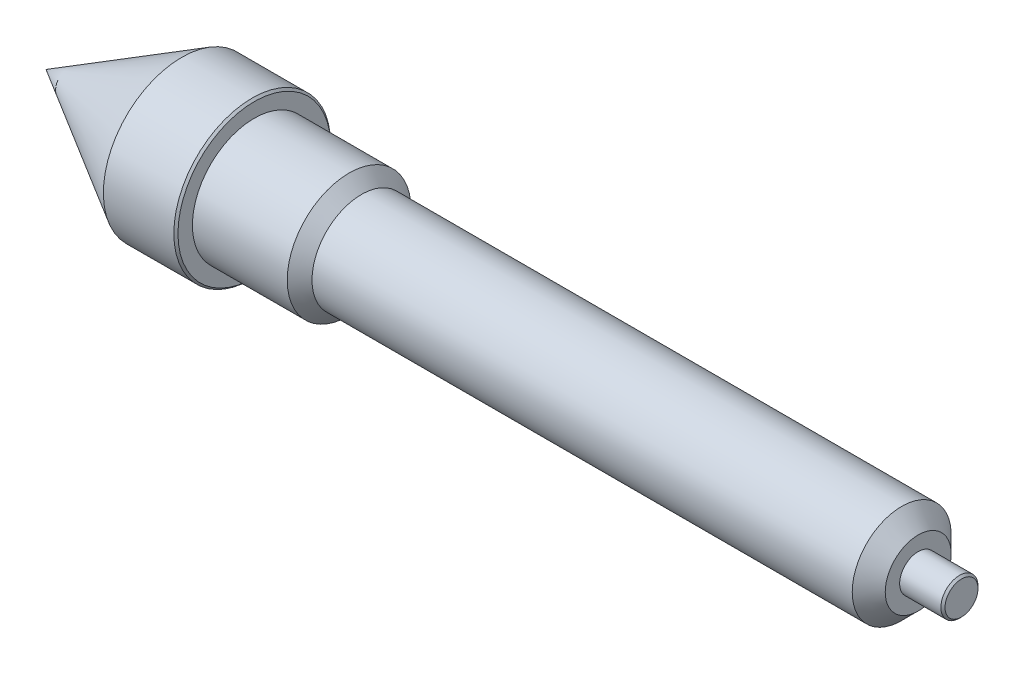
ISO-10303-21;
HEADER;
FILE_DESCRIPTION(('STEP AP214'),'2;1');
FILE_NAME('part.step','',(''),(''),'','','');
FILE_SCHEMA(('AUTOMOTIVE_DESIGN { 1 0 10303 214 1 1 1 1 }'));
ENDSEC;
DATA;
#1=APPLICATION_CONTEXT('core data for automotive mechanical design processes');
#2=APPLICATION_PROTOCOL_DEFINITION('international standard','automotive_design',2000,#1);
#3=PRODUCT_CONTEXT('',#1,'mechanical');
#4=PRODUCT('Part','Part','',(#3));
#5=PRODUCT_RELATED_PRODUCT_CATEGORY('part','',(#4));
#6=PRODUCT_DEFINITION_FORMATION('','',#4);
#7=PRODUCT_DEFINITION_CONTEXT('part definition',#1,'design');
#8=PRODUCT_DEFINITION('design','',#6,#7);
#9=PRODUCT_DEFINITION_SHAPE('','',#8);
#10=(LENGTH_UNIT() NAMED_UNIT(*) SI_UNIT(.MILLI.,.METRE.));
#11=(NAMED_UNIT(*) PLANE_ANGLE_UNIT() SI_UNIT($,.RADIAN.));
#12=(NAMED_UNIT(*) SI_UNIT($,.STERADIAN.) SOLID_ANGLE_UNIT());
#13=UNCERTAINTY_MEASURE_WITH_UNIT(LENGTH_MEASURE(1.E-05),#10,'distance_accuracy_value','');
#14=(GEOMETRIC_REPRESENTATION_CONTEXT(3) GLOBAL_UNCERTAINTY_ASSIGNED_CONTEXT((#13)) GLOBAL_UNIT_ASSIGNED_CONTEXT((#10,
#11,#12)) REPRESENTATION_CONTEXT('',''));
#15=CARTESIAN_POINT('',(0.,0.,0.));
#16=DIRECTION('',(0.,0.,1.));
#17=DIRECTION('',(1.,0.,0.));
#18=AXIS2_PLACEMENT_3D('',#15,#16,#17);
#19=CARTESIAN_POINT('',(10.5,0.,0.));
#20=DIRECTION('',(-1.,0.,0.));
#21=DIRECTION('',(0.,0.,1.));
#22=AXIS2_PLACEMENT_3D('',#19,#20,#21);
#23=CYLINDRICAL_SURFACE('',#22,4.5);
#24=CARTESIAN_POINT('',(10.,0.,0.));
#25=DIRECTION('',(1.,0.,0.));
#26=DIRECTION('',(0.,0.,-1.));
#27=AXIS2_PLACEMENT_3D('',#24,#25,#26);
#28=CIRCLE('',#27,4.5);
#29=CARTESIAN_POINT('',(10.,0.,4.5));
#30=VERTEX_POINT('',#29);
#31=EDGE_CURVE('E75',#30,#30,#28,.F.);
#32=CARTESIAN_POINT('',(0.,0.,0.));
#33=DIRECTION('',(1.,0.,0.));
#34=DIRECTION('',(0.,0.,-1.));
#35=AXIS2_PLACEMENT_3D('',#32,#33,#34);
#36=CIRCLE('',#35,4.5);
#37=CARTESIAN_POINT('',(0.,0.,4.5));
#38=VERTEX_POINT('',#37);
#39=EDGE_CURVE('E69',#38,#38,#36,.T.);
#40=CARTESIAN_POINT('',(10.,0.,4.5));
#41=CARTESIAN_POINT('',(9.89583333333333,0.,4.5));
#42=CARTESIAN_POINT('',(9.79166666666666,0.,4.5));
#43=CARTESIAN_POINT('',(9.58333333333333,0.,4.5));
#44=CARTESIAN_POINT('',(9.47916666666667,0.,4.5));
#45=CARTESIAN_POINT('',(9.27083333333333,0.,4.5));
#46=CARTESIAN_POINT('',(9.16666666666666,0.,4.5));
#47=CARTESIAN_POINT('',(8.95833333333333,0.,4.5));
#48=CARTESIAN_POINT('',(8.85416666666666,0.,4.5));
#49=CARTESIAN_POINT('',(8.64583333333333,0.,4.5));
#50=CARTESIAN_POINT('',(8.54166666666666,0.,4.5));
#51=CARTESIAN_POINT('',(8.33333333333333,0.,4.5));
#52=CARTESIAN_POINT('',(8.22916666666667,0.,4.5));
#53=CARTESIAN_POINT('',(8.02083333333333,0.,4.5));
#54=CARTESIAN_POINT('',(7.91666666666667,0.,4.5));
#55=CARTESIAN_POINT('',(7.70833333333333,0.,4.5));
#56=CARTESIAN_POINT('',(7.60416666666666,0.,4.5));
#57=CARTESIAN_POINT('',(7.39583333333333,0.,4.5));
#58=CARTESIAN_POINT('',(7.29166666666666,0.,4.5));
#59=CARTESIAN_POINT('',(7.08333333333333,0.,4.5));
#60=CARTESIAN_POINT('',(6.97916666666667,0.,4.5));
#61=CARTESIAN_POINT('',(6.77083333333333,0.,4.5));
#62=CARTESIAN_POINT('',(6.66666666666667,0.,4.5));
#63=CARTESIAN_POINT('',(6.45833333333333,0.,4.5));
#64=CARTESIAN_POINT('',(6.35416666666667,0.,4.5));
#65=CARTESIAN_POINT('',(6.14583333333333,0.,4.5));
#66=CARTESIAN_POINT('',(6.04166666666667,0.,4.5));
#67=CARTESIAN_POINT('',(5.83333333333333,0.,4.5));
#68=CARTESIAN_POINT('',(5.72916666666667,0.,4.5));
#69=CARTESIAN_POINT('',(5.52083333333333,0.,4.5));
#70=CARTESIAN_POINT('',(5.41666666666667,0.,4.5));
#71=CARTESIAN_POINT('',(5.20833333333333,0.,4.5));
#72=CARTESIAN_POINT('',(5.10416666666667,0.,4.5));
#73=CARTESIAN_POINT('',(4.89583333333333,0.,4.5));
#74=CARTESIAN_POINT('',(4.79166666666667,0.,4.5));
#75=CARTESIAN_POINT('',(4.58333333333333,0.,4.5));
#76=CARTESIAN_POINT('',(4.47916666666667,0.,4.5));
#77=CARTESIAN_POINT('',(4.27083333333333,0.,4.5));
#78=CARTESIAN_POINT('',(4.16666666666667,0.,4.5));
#79=CARTESIAN_POINT('',(3.95833333333333,0.,4.5));
#80=CARTESIAN_POINT('',(3.85416666666667,0.,4.5));
#81=CARTESIAN_POINT('',(3.64583333333333,0.,4.5));
#82=CARTESIAN_POINT('',(3.54166666666667,0.,4.5));
#83=CARTESIAN_POINT('',(3.33333333333333,0.,4.5));
#84=CARTESIAN_POINT('',(3.22916666666667,0.,4.5));
#85=CARTESIAN_POINT('',(3.02083333333333,0.,4.5));
#86=CARTESIAN_POINT('',(2.91666666666667,0.,4.5));
#87=CARTESIAN_POINT('',(2.70833333333333,0.,4.5));
#88=CARTESIAN_POINT('',(2.60416666666667,0.,4.5));
#89=CARTESIAN_POINT('',(2.39583333333333,0.,4.5));
#90=CARTESIAN_POINT('',(2.29166666666667,0.,4.5));
#91=CARTESIAN_POINT('',(2.08333333333333,0.,4.5));
#92=CARTESIAN_POINT('',(1.97916666666667,0.,4.5));
#93=CARTESIAN_POINT('',(1.77083333333333,0.,4.5));
#94=CARTESIAN_POINT('',(1.66666666666667,0.,4.5));
#95=CARTESIAN_POINT('',(1.45833333333333,0.,4.5));
#96=CARTESIAN_POINT('',(1.35416666666667,0.,4.5));
#97=CARTESIAN_POINT('',(1.14583333333333,0.,4.5));
#98=CARTESIAN_POINT('',(1.04166666666667,0.,4.5));
#99=CARTESIAN_POINT('',(0.833333333333333,0.,4.5));
#100=CARTESIAN_POINT('',(0.729166666666667,0.,4.5));
#101=CARTESIAN_POINT('',(0.520833333333334,0.,4.5));
#102=CARTESIAN_POINT('',(0.416666666666667,0.,4.5));
#103=CARTESIAN_POINT('',(0.208333333333334,0.,4.5));
#104=CARTESIAN_POINT('',(0.104166666666667,0.,4.5));
#105=CARTESIAN_POINT('',(0.,0.,4.5));
#106=B_SPLINE_CURVE_WITH_KNOTS('',3,(#40,#41,#42,#43,#44,#45,#46,#47,#48,#49,#50,#51,#52,#53,
#54,#55,#56,#57,#58,#59,#60,#61,#62,#63,#64,#65,#66,#67,#68,#69,#70,#71,#72,#73,#74,#75,#76,#77,
#78,#79,#80,#81,#82,#83,#84,#85,#86,#87,#88,#89,#90,#91,#92,#93,#94,#95,#96,#97,#98,#99,#100,
#101,#102,#103,#104,#105),.UNSPECIFIED.,.F.,.F.,(4,2,2,2,2,2,2,2,2,2,2,2,2,2,2,2,2,2,2,2,2,2,2,
2,2,2,2,2,2,2,2,2,4),(0.,0.312499999999999,0.624999999999999,0.937499999999999,1.25,1.5625,
1.875,2.1875,2.5,2.8125,3.125,3.4375,3.75,4.0625,4.375,4.6875,5.,5.3125,5.625,5.9375,6.25,
6.5625,6.875,7.1875,7.5,7.8125,8.125,8.4375,8.75,9.0625,9.375,9.6875,10.),.UNSPECIFIED.);
#107=EDGE_CURVE('BSEAM41',#30,#38,#106,.T.);
#108=ORIENTED_EDGE('',*,*,#31,.T.);
#109=ORIENTED_EDGE('',*,*,#39,.T.);
#110=ORIENTED_EDGE('',*,*,#107,.T.);
#111=ORIENTED_EDGE('',*,*,#107,.F.);
#112=EDGE_LOOP('',(#108,#110,#109,#111));
#113=FACE_BOUND('',#112,.T.);
#114=ADVANCED_FACE('F41',(#113),#23,.T.);
#115=CARTESIAN_POINT('',(10.5,0.,0.));
#116=DIRECTION('',(1.,0.,0.));
#117=DIRECTION('',(0.,0.,-1.));
#118=AXIS2_PLACEMENT_3D('',#115,#116,#117);
#119=PLANE('',#118);
#120=CARTESIAN_POINT('',(10.5,0.,0.));
#121=DIRECTION('',(1.,0.,0.));
#122=DIRECTION('',(0.,0.,-1.));
#123=AXIS2_PLACEMENT_3D('',#120,#121,#122);
#124=CIRCLE('',#123,4.);
#125=CARTESIAN_POINT('',(10.5,0.,-4.));
#126=VERTEX_POINT('',#125);
#127=EDGE_CURVE('E72',#126,#126,#124,.T.);
#128=ORIENTED_EDGE('',*,*,#127,.T.);
#129=EDGE_LOOP('',(#128));
#130=FACE_BOUND('',#129,.T.);
#131=ADVANCED_FACE('F97',(#130),#119,.T.);
#132=CARTESIAN_POINT('',(10.5,0.,0.));
#133=DIRECTION('',(-1.,0.,0.));
#134=DIRECTION('',(0.,0.,1.));
#135=AXIS2_PLACEMENT_3D('',#132,#133,#134);
#136=CONICAL_SURFACE('',#135,4.,0.785398163397451);
#137=ORIENTED_EDGE('',*,*,#31,.F.);
#138=EDGE_LOOP('',(#137));
#139=FACE_BOUND('',#138,.T.);
#140=ORIENTED_EDGE('',*,*,#127,.F.);
#141=EDGE_LOOP('',(#140));
#142=FACE_BOUND('',#141,.T.);
#143=ADVANCED_FACE('F103',(#139,#142),#136,.T.);
#144=CARTESIAN_POINT('',(-135.,0.,0.));
#145=DIRECTION('',(1.,0.,0.));
#146=DIRECTION('',(0.,0.,-1.));
#147=AXIS2_PLACEMENT_3D('',#144,#145,#146);
#148=CYLINDRICAL_SURFACE('',#147,12.);
#149=CARTESIAN_POINT('',(-4.,0.,0.));
#150=DIRECTION('',(-1.,0.,0.));
#151=DIRECTION('',(0.,0.,1.));
#152=AXIS2_PLACEMENT_3D('',#149,#150,#151);
#153=CIRCLE('',#152,12.);
#154=CARTESIAN_POINT('',(-4.,0.,12.));
#155=VERTEX_POINT('',#154);
#156=EDGE_CURVE('E78',#155,#155,#153,.T.);
#157=ORIENTED_EDGE('',*,*,#156,.T.);
#158=EDGE_LOOP('',(#157));
#159=FACE_BOUND('',#158,.T.);
#160=CARTESIAN_POINT('',(-135.,0.,0.));
#161=DIRECTION('',(-1.,0.,0.));
#162=DIRECTION('',(0.,0.,1.));
#163=AXIS2_PLACEMENT_3D('',#160,#161,#162);
#164=CIRCLE('',#163,12.);
#165=CARTESIAN_POINT('',(-135.,0.,12.));
#166=VERTEX_POINT('',#165);
#167=EDGE_CURVE('E64',#166,#166,#164,.T.);
#168=ORIENTED_EDGE('',*,*,#167,.F.);
#169=EDGE_LOOP('',(#168));
#170=FACE_BOUND('',#169,.T.);
#171=ADVANCED_FACE('F115',(#159,#170),#148,.T.);
#172=CARTESIAN_POINT('',(0.,0.,0.));
#173=DIRECTION('',(-1.,0.,0.));
#174=DIRECTION('',(0.,0.,1.));
#175=AXIS2_PLACEMENT_3D('',#172,#173,#174);
#176=PLANE('',#175);
#177=CARTESIAN_POINT('',(0.,0.,0.));
#178=DIRECTION('',(-1.,0.,0.));
#179=DIRECTION('',(0.,0.,1.));
#180=AXIS2_PLACEMENT_3D('',#177,#178,#179);
#181=CIRCLE('',#180,7.99999999999998);
#182=CARTESIAN_POINT('',(0.,0.,7.99999999999998));
#183=VERTEX_POINT('',#182);
#184=EDGE_CURVE('E81',#183,#183,#181,.F.);
#185=ORIENTED_EDGE('',*,*,#184,.T.);
#186=EDGE_LOOP('',(#185));
#187=FACE_BOUND('',#186,.T.);
#188=ORIENTED_EDGE('',*,*,#39,.F.);
#189=EDGE_LOOP('',(#188));
#190=FACE_BOUND('',#189,.T.);
#191=ADVANCED_FACE('F123',(#187,#190),#176,.F.);
#192=CARTESIAN_POINT('',(-4.,0.,0.));
#193=DIRECTION('',(-1.,0.,0.));
#194=DIRECTION('',(0.,0.,1.));
#195=AXIS2_PLACEMENT_3D('',#192,#193,#194);
#196=CONICAL_SURFACE('',#195,12.,0.78539816339745);
#197=ORIENTED_EDGE('',*,*,#184,.F.);
#198=EDGE_LOOP('',(#197));
#199=FACE_BOUND('',#198,.T.);
#200=ORIENTED_EDGE('',*,*,#156,.F.);
#201=EDGE_LOOP('',(#200));
#202=FACE_BOUND('',#201,.T.);
#203=ADVANCED_FACE('F117',(#199,#202),#196,.T.);
#204=CARTESIAN_POINT('',(-161.,0.,0.));
#205=DIRECTION('',(1.,0.,0.));
#206=DIRECTION('',(0.,0.,-1.));
#207=AXIS2_PLACEMENT_3D('',#204,#205,#206);
#208=CYLINDRICAL_SURFACE('',#207,15.);
#209=CARTESIAN_POINT('',(-138.,0.,0.));
#210=DIRECTION('',(-1.,0.,0.));
#211=DIRECTION('',(0.,0.,1.));
#212=AXIS2_PLACEMENT_3D('',#209,#210,#211);
#213=CIRCLE('',#212,15.);
#214=CARTESIAN_POINT('',(-138.,0.,-15.));
#215=VERTEX_POINT('',#214);
#216=EDGE_CURVE('E84',#215,#215,#213,.T.);
#217=CARTESIAN_POINT('',(-161.,0.,0.));
#218=DIRECTION('',(-1.,0.,0.));
#219=DIRECTION('',(0.,0.,1.));
#220=AXIS2_PLACEMENT_3D('',#217,#218,#219);
#221=CIRCLE('',#220,15.);
#222=CARTESIAN_POINT('',(-161.,0.,-15.));
#223=VERTEX_POINT('',#222);
#224=EDGE_CURVE('E61',#223,#223,#221,.T.);
#225=CARTESIAN_POINT('',(-138.,0.,-15.));
#226=CARTESIAN_POINT('',(-138.239583333333,0.,-15.));
#227=CARTESIAN_POINT('',(-138.479166666667,0.,-15.));
#228=CARTESIAN_POINT('',(-138.958333333333,0.,-15.));
#229=CARTESIAN_POINT('',(-139.197916666667,0.,-15.));
#230=CARTESIAN_POINT('',(-139.677083333333,0.,-15.));
#231=CARTESIAN_POINT('',(-139.916666666667,0.,-15.));
#232=CARTESIAN_POINT('',(-140.395833333333,0.,-15.));
#233=CARTESIAN_POINT('',(-140.635416666667,0.,-15.));
#234=CARTESIAN_POINT('',(-141.114583333333,0.,-15.));
#235=CARTESIAN_POINT('',(-141.354166666667,0.,-15.));
#236=CARTESIAN_POINT('',(-141.833333333333,0.,-15.));
#237=CARTESIAN_POINT('',(-142.072916666667,0.,-15.));
#238=CARTESIAN_POINT('',(-142.552083333333,0.,-15.));
#239=CARTESIAN_POINT('',(-142.791666666667,0.,-15.));
#240=CARTESIAN_POINT('',(-143.270833333333,0.,-15.));
#241=CARTESIAN_POINT('',(-143.510416666667,0.,-15.));
#242=CARTESIAN_POINT('',(-143.989583333333,0.,-15.));
#243=CARTESIAN_POINT('',(-144.229166666667,0.,-15.));
#244=CARTESIAN_POINT('',(-144.708333333333,0.,-15.));
#245=CARTESIAN_POINT('',(-144.947916666667,0.,-15.));
#246=CARTESIAN_POINT('',(-145.427083333333,0.,-15.));
#247=CARTESIAN_POINT('',(-145.666666666667,0.,-15.));
#248=CARTESIAN_POINT('',(-146.145833333333,0.,-15.));
#249=CARTESIAN_POINT('',(-146.385416666667,0.,-15.));
#250=CARTESIAN_POINT('',(-146.864583333333,0.,-15.));
#251=CARTESIAN_POINT('',(-147.104166666667,0.,-15.));
#252=CARTESIAN_POINT('',(-147.583333333333,0.,-15.));
#253=CARTESIAN_POINT('',(-147.822916666667,0.,-15.));
#254=CARTESIAN_POINT('',(-148.302083333333,0.,-15.));
#255=CARTESIAN_POINT('',(-148.541666666667,0.,-15.));
#256=CARTESIAN_POINT('',(-149.020833333333,0.,-15.));
#257=CARTESIAN_POINT('',(-149.260416666667,0.,-15.));
#258=CARTESIAN_POINT('',(-149.739583333333,0.,-15.));
#259=CARTESIAN_POINT('',(-149.979166666667,0.,-15.));
#260=CARTESIAN_POINT('',(-150.458333333333,0.,-15.));
#261=CARTESIAN_POINT('',(-150.697916666667,0.,-15.));
#262=CARTESIAN_POINT('',(-151.177083333333,0.,-15.));
#263=CARTESIAN_POINT('',(-151.416666666667,0.,-15.));
#264=CARTESIAN_POINT('',(-151.895833333333,0.,-15.));
#265=CARTESIAN_POINT('',(-152.135416666667,0.,-15.));
#266=CARTESIAN_POINT('',(-152.614583333333,0.,-15.));
#267=CARTESIAN_POINT('',(-152.854166666667,0.,-15.));
#268=CARTESIAN_POINT('',(-153.333333333333,0.,-15.));
#269=CARTESIAN_POINT('',(-153.572916666667,0.,-15.));
#270=CARTESIAN_POINT('',(-154.052083333333,0.,-15.));
#271=CARTESIAN_POINT('',(-154.291666666667,0.,-15.));
#272=CARTESIAN_POINT('',(-154.770833333333,0.,-15.));
#273=CARTESIAN_POINT('',(-155.010416666667,0.,-15.));
#274=CARTESIAN_POINT('',(-155.489583333333,0.,-15.));
#275=CARTESIAN_POINT('',(-155.729166666667,0.,-15.));
#276=CARTESIAN_POINT('',(-156.208333333333,0.,-15.));
#277=CARTESIAN_POINT('',(-156.447916666667,0.,-15.));
#278=CARTESIAN_POINT('',(-156.927083333333,0.,-15.));
#279=CARTESIAN_POINT('',(-157.166666666667,0.,-15.));
#280=CARTESIAN_POINT('',(-157.645833333333,0.,-15.));
#281=CARTESIAN_POINT('',(-157.885416666667,0.,-15.));
#282=CARTESIAN_POINT('',(-158.364583333333,0.,-15.));
#283=CARTESIAN_POINT('',(-158.604166666667,0.,-15.));
#284=CARTESIAN_POINT('',(-159.083333333333,0.,-15.));
#285=CARTESIAN_POINT('',(-159.322916666667,0.,-15.));
#286=CARTESIAN_POINT('',(-159.802083333333,0.,-15.));
#287=CARTESIAN_POINT('',(-160.041666666667,0.,-15.));
#288=CARTESIAN_POINT('',(-160.520833333333,0.,-15.));
#289=CARTESIAN_POINT('',(-160.760416666667,0.,-15.));
#290=CARTESIAN_POINT('',(-161.,0.,-15.));
#291=B_SPLINE_CURVE_WITH_KNOTS('',3,(#225,#226,#227,#228,#229,#230,#231,#232,#233,#234,#235,
#236,#237,#238,#239,#240,#241,#242,#243,#244,#245,#246,#247,#248,#249,#250,#251,#252,#253,#254,
#255,#256,#257,#258,#259,#260,#261,#262,#263,#264,#265,#266,#267,#268,#269,#270,#271,#272,#273,
#274,#275,#276,#277,#278,#279,#280,#281,#282,#283,#284,#285,#286,#287,#288,#289,#290),
.UNSPECIFIED.,.F.,.F.,(4,2,2,2,2,2,2,2,2,2,2,2,2,2,2,2,2,2,2,2,2,2,2,2,2,2,2,2,2,2,2,2,4),(0.,
0.718750000000018,1.43750000000001,2.15625,2.87499999999999,3.59375000000001,4.3125,
5.03124999999999,5.75000000000001,6.46875,7.18749999999999,7.90624999999998,8.62499999999999,
9.34374999999998,10.0625,10.78125,11.5,12.21875,12.9375,13.65625,14.375,15.09375,15.8125,
16.53125,17.25,17.96875,18.6875,19.40625,20.125,20.84375,21.5625,22.2812499999999,23.),.UNSPECIFIED.);
#292=EDGE_CURVE('BSEAM122',#215,#223,#291,.T.);
#293=ORIENTED_EDGE('',*,*,#216,.T.);
#294=ORIENTED_EDGE('',*,*,#224,.F.);
#295=ORIENTED_EDGE('',*,*,#292,.T.);
#296=ORIENTED_EDGE('',*,*,#292,.F.);
#297=EDGE_LOOP('',(#293,#295,#294,#296));
#298=FACE_BOUND('',#297,.T.);
#299=ADVANCED_FACE('F122',(#298),#208,.T.);
#300=CARTESIAN_POINT('',(-138.,0.,0.));
#301=DIRECTION('',(-1.,0.,0.));
#302=DIRECTION('',(0.,0.,1.));
#303=AXIS2_PLACEMENT_3D('',#300,#301,#302);
#304=CONICAL_SURFACE('',#303,15.,0.785398163397451);
#305=ORIENTED_EDGE('',*,*,#167,.T.);
#306=EDGE_LOOP('',(#305));
#307=FACE_BOUND('',#306,.T.);
#308=ORIENTED_EDGE('',*,*,#216,.F.);
#309=EDGE_LOOP('',(#308));
#310=FACE_BOUND('',#309,.T.);
#311=ADVANCED_FACE('F125',(#307,#310),#304,.T.);
#312=CARTESIAN_POINT('',(-178.59,0.,0.));
#313=DIRECTION('',(1.,0.,0.));
#314=DIRECTION('',(0.,0.,-1.));
#315=AXIS2_PLACEMENT_3D('',#312,#313,#314);
#316=CYLINDRICAL_SURFACE('',#315,19.);
#317=CARTESIAN_POINT('',(-161.5,0.,0.));
#318=DIRECTION('',(-1.,0.,0.));
#319=DIRECTION('',(0.,0.,1.));
#320=AXIS2_PLACEMENT_3D('',#317,#318,#319);
#321=CIRCLE('',#320,19.);
#322=CARTESIAN_POINT('',(-161.5,0.,-19.));
#323=VERTEX_POINT('',#322);
#324=EDGE_CURVE('E49',#323,#323,#321,.T.);
#325=CARTESIAN_POINT('',(-178.59,0.,0.));
#326=DIRECTION('',(-1.,0.,0.));
#327=DIRECTION('',(0.,0.,1.));
#328=AXIS2_PLACEMENT_3D('',#325,#326,#327);
#329=CIRCLE('',#328,19.);
#330=CARTESIAN_POINT('',(-178.59,0.,-19.));
#331=VERTEX_POINT('',#330);
#332=EDGE_CURVE('E59',#331,#331,#329,.T.);
#333=CARTESIAN_POINT('',(-161.5,0.,-19.));
#334=CARTESIAN_POINT('',(-161.678020833333,0.,-19.));
#335=CARTESIAN_POINT('',(-161.856041666667,0.,-19.));
#336=CARTESIAN_POINT('',(-162.212083333333,0.,-19.));
#337=CARTESIAN_POINT('',(-162.390104166667,0.,-19.));
#338=CARTESIAN_POINT('',(-162.746145833333,0.,-19.));
#339=CARTESIAN_POINT('',(-162.924166666667,0.,-19.));
#340=CARTESIAN_POINT('',(-163.280208333333,0.,-19.));
#341=CARTESIAN_POINT('',(-163.458229166667,0.,-19.));
#342=CARTESIAN_POINT('',(-163.814270833333,0.,-19.));
#343=CARTESIAN_POINT('',(-163.992291666667,0.,-19.));
#344=CARTESIAN_POINT('',(-164.348333333333,0.,-19.));
#345=CARTESIAN_POINT('',(-164.526354166667,0.,-19.));
#346=CARTESIAN_POINT('',(-164.882395833333,0.,-19.));
#347=CARTESIAN_POINT('',(-165.060416666667,0.,-19.));
#348=CARTESIAN_POINT('',(-165.416458333333,0.,-19.));
#349=CARTESIAN_POINT('',(-165.594479166667,0.,-19.));
#350=CARTESIAN_POINT('',(-165.950520833333,0.,-19.));
#351=CARTESIAN_POINT('',(-166.128541666667,0.,-19.));
#352=CARTESIAN_POINT('',(-166.484583333333,0.,-19.));
#353=CARTESIAN_POINT('',(-166.662604166667,0.,-19.));
#354=CARTESIAN_POINT('',(-167.018645833333,0.,-19.));
#355=CARTESIAN_POINT('',(-167.196666666667,0.,-19.));
#356=CARTESIAN_POINT('',(-167.552708333333,0.,-19.));
#357=CARTESIAN_POINT('',(-167.730729166667,0.,-19.));
#358=CARTESIAN_POINT('',(-168.086770833333,0.,-19.));
#359=CARTESIAN_POINT('',(-168.264791666667,0.,-19.));
#360=CARTESIAN_POINT('',(-168.620833333333,0.,-19.));
#361=CARTESIAN_POINT('',(-168.798854166667,0.,-19.));
#362=CARTESIAN_POINT('',(-169.154895833333,0.,-19.));
#363=CARTESIAN_POINT('',(-169.332916666667,0.,-19.));
#364=CARTESIAN_POINT('',(-169.688958333333,0.,-19.));
#365=CARTESIAN_POINT('',(-169.866979166667,0.,-19.));
#366=CARTESIAN_POINT('',(-170.223020833333,0.,-19.));
#367=CARTESIAN_POINT('',(-170.401041666667,0.,-19.));
#368=CARTESIAN_POINT('',(-170.757083333333,0.,-19.));
#369=CARTESIAN_POINT('',(-170.935104166667,0.,-19.));
#370=CARTESIAN_POINT('',(-171.291145833333,0.,-19.));
#371=CARTESIAN_POINT('',(-171.469166666667,0.,-19.));
#372=CARTESIAN_POINT('',(-171.825208333333,0.,-19.));
#373=CARTESIAN_POINT('',(-172.003229166667,0.,-19.));
#374=CARTESIAN_POINT('',(-172.359270833333,0.,-19.));
#375=CARTESIAN_POINT('',(-172.537291666667,0.,-19.));
#376=CARTESIAN_POINT('',(-172.893333333333,0.,-19.));
#377=CARTESIAN_POINT('',(-173.071354166667,0.,-19.));
#378=CARTESIAN_POINT('',(-173.427395833333,0.,-19.));
#379=CARTESIAN_POINT('',(-173.605416666667,0.,-19.));
#380=CARTESIAN_POINT('',(-173.961458333333,0.,-19.));
#381=CARTESIAN_POINT('',(-174.139479166667,0.,-19.));
#382=CARTESIAN_POINT('',(-174.495520833333,0.,-19.));
#383=CARTESIAN_POINT('',(-174.673541666667,0.,-19.));
#384=CARTESIAN_POINT('',(-175.029583333333,0.,-19.));
#385=CARTESIAN_POINT('',(-175.207604166667,0.,-19.));
#386=CARTESIAN_POINT('',(-175.563645833333,0.,-19.));
#387=CARTESIAN_POINT('',(-175.741666666667,0.,-19.));
#388=CARTESIAN_POINT('',(-176.097708333333,0.,-19.));
#389=CARTESIAN_POINT('',(-176.275729166667,0.,-19.));
#390=CARTESIAN_POINT('',(-176.631770833333,0.,-19.));
#391=CARTESIAN_POINT('',(-176.809791666667,0.,-19.));
#392=CARTESIAN_POINT('',(-177.165833333333,0.,-19.));
#393=CARTESIAN_POINT('',(-177.343854166667,0.,-19.));
#394=CARTESIAN_POINT('',(-177.699895833333,0.,-19.));
#395=CARTESIAN_POINT('',(-177.877916666667,0.,-19.));
#396=CARTESIAN_POINT('',(-178.233958333333,0.,-19.));
#397=CARTESIAN_POINT('',(-178.411979166667,0.,-19.));
#398=CARTESIAN_POINT('',(-178.59,0.,-19.));
#399=B_SPLINE_CURVE_WITH_KNOTS('',3,(#333,#334,#335,#336,#337,#338,#339,#340,#341,#342,#343,
#344,#345,#346,#347,#348,#349,#350,#351,#352,#353,#354,#355,#356,#357,#358,#359,#360,#361,#362,
#363,#364,#365,#366,#367,#368,#369,#370,#371,#372,#373,#374,#375,#376,#377,#378,#379,#380,#381,
#382,#383,#384,#385,#386,#387,#388,#389,#390,#391,#392,#393,#394,#395,#396,#397,#398),
.UNSPECIFIED.,.F.,.F.,(4,2,2,2,2,2,2,2,2,2,2,2,2,2,2,2,2,2,2,2,2,2,2,2,2,2,2,2,2,2,2,2,4),(0.,
0.534062499999988,1.06812499999998,1.60218749999999,2.13624999999998,2.67031249999997,
3.20437499999995,3.73843749999997,4.27249999999996,4.80656249999995,5.34062499999996,
5.87468749999995,6.40874999999994,6.94281249999995,7.47687499999994,8.01093749999993,
8.54499999999994,9.07906249999993,9.61312499999992,10.1471874999999,10.6812499999999,
11.2153124999999,11.7493749999999,12.2834374999999,12.8174999999999,13.3515624999999,
13.8856249999999,14.4196874999999,14.9537499999999,15.4878124999999,16.0218749999999,
16.5559374999999,17.0899999999999),.UNSPECIFIED.);
#400=EDGE_CURVE('BSEAM89',#323,#331,#399,.T.);
#401=ORIENTED_EDGE('',*,*,#324,.T.);
#402=ORIENTED_EDGE('',*,*,#332,.F.);
#403=ORIENTED_EDGE('',*,*,#400,.T.);
#404=ORIENTED_EDGE('',*,*,#400,.F.);
#405=EDGE_LOOP('',(#401,#403,#402,#404));
#406=FACE_BOUND('',#405,.T.);
#407=ADVANCED_FACE('F89',(#406),#316,.T.);
#408=CARTESIAN_POINT('',(-161.,0.,0.));
#409=DIRECTION('',(-1.,0.,0.));
#410=DIRECTION('',(0.,0.,1.));
#411=AXIS2_PLACEMENT_3D('',#408,#409,#410);
#412=PLANE('',#411);
#413=CARTESIAN_POINT('',(-161.,0.,0.));
#414=DIRECTION('',(-1.,0.,0.));
#415=DIRECTION('',(0.,0.,1.));
#416=AXIS2_PLACEMENT_3D('',#413,#414,#415);
#417=CIRCLE('',#416,18.4999999999999);
#418=CARTESIAN_POINT('',(-161.,0.,18.4999999999999));
#419=VERTEX_POINT('',#418);
#420=EDGE_CURVE('E11',#419,#419,#417,.F.);
#421=ORIENTED_EDGE('',*,*,#420,.T.);
#422=EDGE_LOOP('',(#421));
#423=FACE_BOUND('',#422,.T.);
#424=ORIENTED_EDGE('',*,*,#224,.T.);
#425=EDGE_LOOP('',(#424));
#426=FACE_BOUND('',#425,.T.);
#427=ADVANCED_FACE('F55',(#423,#426),#412,.F.);
#428=CARTESIAN_POINT('',(-178.59,0.,0.));
#429=DIRECTION('',(1.,0.,0.));
#430=DIRECTION('',(0.,1.,0.));
#431=AXIS2_PLACEMENT_3D('',#428,#429,#430);
#432=CONICAL_SURFACE('',#431,19.,0.523598775598293);
#433=CARTESIAN_POINT('',(-211.498965343809,0.,0.));
#434=VERTEX_POINT('',#433);
#435=VERTEX_LOOP('',#434);
#436=FACE_BOUND('',#435,.T.);
#437=ORIENTED_EDGE('',*,*,#332,.T.);
#438=EDGE_LOOP('',(#437));
#439=FACE_BOUND('',#438,.T.);
#440=ADVANCED_FACE('F52',(#436,#439),#432,.T.);
#441=CARTESIAN_POINT('',(-161.5,0.,0.));
#442=DIRECTION('',(-1.,0.,0.));
#443=DIRECTION('',(0.,0.,1.));
#444=AXIS2_PLACEMENT_3D('',#441,#442,#443);
#445=CONICAL_SURFACE('',#444,19.,0.785398163397438);
#446=ORIENTED_EDGE('',*,*,#420,.F.);
#447=EDGE_LOOP('',(#446));
#448=FACE_BOUND('',#447,.T.);
#449=ORIENTED_EDGE('',*,*,#324,.F.);
#450=EDGE_LOOP('',(#449));
#451=FACE_BOUND('',#450,.T.);
#452=ADVANCED_FACE('F44',(#448,#451),#445,.T.);
#453=CLOSED_SHELL('',(#114,#131,#143,#171,#191,#203,#299,#311,#407,#427,#440,#452));
#454=MANIFOLD_SOLID_BREP('B2',#453);
#455=ADVANCED_BREP_SHAPE_REPRESENTATION('',(#18,#454),#14);
#456=SHAPE_DEFINITION_REPRESENTATION(#9,#455);
ENDSEC;
END-ISO-10303-21;
